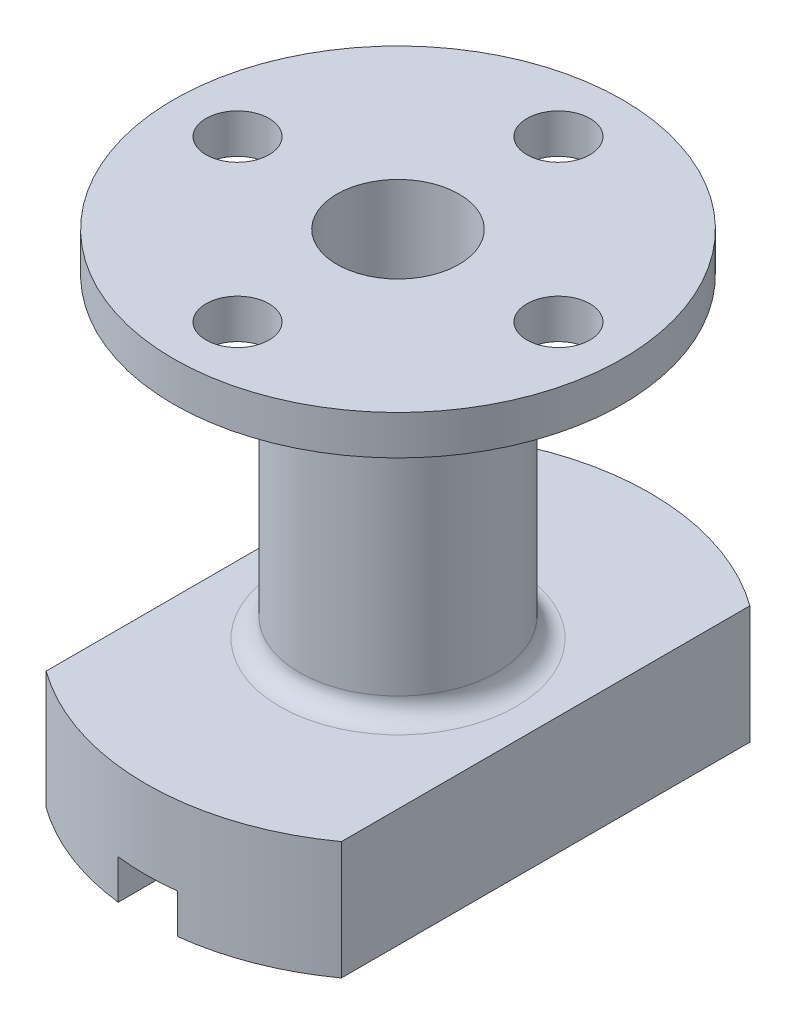
ISO-10303-21;
HEADER;
FILE_DESCRIPTION(('STEP AP214'),'2;1');
FILE_NAME('part.step','',(''),(''),'','','');
FILE_SCHEMA(('AUTOMOTIVE_DESIGN { 1 0 10303 214 1 1 1 1 }'));
ENDSEC;
DATA;
#1=APPLICATION_CONTEXT('core data for automotive mechanical design processes');
#2=APPLICATION_PROTOCOL_DEFINITION('international standard','automotive_design',2000,#1);
#3=PRODUCT_CONTEXT('',#1,'mechanical');
#4=PRODUCT('Part','Part','',(#3));
#5=PRODUCT_RELATED_PRODUCT_CATEGORY('part','',(#4));
#6=PRODUCT_DEFINITION_FORMATION('','',#4);
#7=PRODUCT_DEFINITION_CONTEXT('part definition',#1,'design');
#8=PRODUCT_DEFINITION('design','',#6,#7);
#9=PRODUCT_DEFINITION_SHAPE('','',#8);
#10=(LENGTH_UNIT() NAMED_UNIT(*) SI_UNIT(.MILLI.,.METRE.));
#11=(NAMED_UNIT(*) PLANE_ANGLE_UNIT() SI_UNIT($,.RADIAN.));
#12=(NAMED_UNIT(*) SI_UNIT($,.STERADIAN.) SOLID_ANGLE_UNIT());
#13=UNCERTAINTY_MEASURE_WITH_UNIT(LENGTH_MEASURE(1.E-05),#10,'distance_accuracy_value','');
#14=(GEOMETRIC_REPRESENTATION_CONTEXT(3) GLOBAL_UNCERTAINTY_ASSIGNED_CONTEXT((#13)) GLOBAL_UNIT_ASSIGNED_CONTEXT((#10,
#11,#12)) REPRESENTATION_CONTEXT('',''));
#15=CARTESIAN_POINT('',(0.,0.,0.));
#16=DIRECTION('',(0.,0.,1.));
#17=DIRECTION('',(1.,0.,0.));
#18=AXIS2_PLACEMENT_3D('',#15,#16,#17);
#19=CARTESIAN_POINT('',(1.5,2.,12.7118055365869));
#20=DIRECTION('',(1.,0.,0.));
#21=DIRECTION('',(0.,0.,-1.));
#22=AXIS2_PLACEMENT_3D('',#19,#20,#21);
#23=PLANE('',#22);
#24=DIRECTION('',(0.,0.,1.));
#25=VECTOR('',#24,1.);
#26=CARTESIAN_POINT('',(1.5,2.,12.7118055365869));
#27=LINE('',#26,#25);
#28=CARTESIAN_POINT('',(1.5,2.,2.71293199325011));
#29=VERTEX_POINT('',#28);
#30=CARTESIAN_POINT('',(1.5,2.,12.7118055365869));
#31=VERTEX_POINT('',#30);
#32=EDGE_CURVE('E275',#29,#31,#27,.T.);
#33=ORIENTED_EDGE('',*,*,#32,.F.);
#34=DIRECTION('',(0.,-1.,0.));
#35=VECTOR('',#34,1.);
#36=CARTESIAN_POINT('',(1.5,22.001,2.71293199325011));
#37=LINE('',#36,#35);
#38=CARTESIAN_POINT('',(1.5,0.,2.71293199325011));
#39=VERTEX_POINT('',#38);
#40=EDGE_CURVE('E135',#39,#29,#37,.F.);
#41=ORIENTED_EDGE('',*,*,#40,.F.);
#42=DIRECTION('',(0.,0.,1.));
#43=VECTOR('',#42,1.);
#44=CARTESIAN_POINT('',(1.5,0.,12.7118055365869));
#45=LINE('',#44,#43);
#46=CARTESIAN_POINT('',(1.5,0.,12.7118055365869));
#47=VERTEX_POINT('',#46);
#48=EDGE_CURVE('E153',#39,#47,#45,.T.);
#49=ORIENTED_EDGE('',*,*,#48,.T.);
#50=DIRECTION('',(0.,-1.,0.));
#51=VECTOR('',#50,1.);
#52=CARTESIAN_POINT('',(1.5,2.,12.7118055365869));
#53=LINE('',#52,#51);
#54=EDGE_CURVE('E165',#31,#47,#53,.T.);
#55=ORIENTED_EDGE('',*,*,#54,.F.);
#56=EDGE_LOOP('',(#33,#41,#49,#55));
#57=FACE_BOUND('',#56,.T.);
#58=ADVANCED_FACE('F39',(#57),#23,.F.);
#59=CARTESIAN_POINT('',(-1.5,2.,12.7118055365869));
#60=DIRECTION('',(-1.,0.,0.));
#61=DIRECTION('',(0.,0.,1.));
#62=AXIS2_PLACEMENT_3D('',#59,#60,#61);
#63=PLANE('',#62);
#64=DIRECTION('',(0.,0.,-1.));
#65=VECTOR('',#64,1.);
#66=CARTESIAN_POINT('',(-1.5,2.,12.7118055365869));
#67=LINE('',#66,#65);
#68=CARTESIAN_POINT('',(-1.5,2.,-2.71293199325011));
#69=VERTEX_POINT('',#68);
#70=CARTESIAN_POINT('',(-1.5,2.,-12.7118055365869));
#71=VERTEX_POINT('',#70);
#72=EDGE_CURVE('E143',#69,#71,#67,.T.);
#73=ORIENTED_EDGE('',*,*,#72,.F.);
#74=DIRECTION('',(0.,-1.,0.));
#75=VECTOR('',#74,1.);
#76=CARTESIAN_POINT('',(-1.5,22.001,-2.71293199325011));
#77=LINE('',#76,#75);
#78=CARTESIAN_POINT('',(-1.5,0.,-2.71293199325011));
#79=VERTEX_POINT('',#78);
#80=EDGE_CURVE('E54',#79,#69,#77,.F.);
#81=ORIENTED_EDGE('',*,*,#80,.F.);
#82=DIRECTION('',(0.,0.,-1.));
#83=VECTOR('',#82,1.);
#84=CARTESIAN_POINT('',(-1.5,0.,12.7118055365869));
#85=LINE('',#84,#83);
#86=CARTESIAN_POINT('',(-1.5,0.,-12.7118055365869));
#87=VERTEX_POINT('',#86);
#88=EDGE_CURVE('E141',#79,#87,#85,.T.);
#89=ORIENTED_EDGE('',*,*,#88,.T.);
#90=DIRECTION('',(0.,-1.,0.));
#91=VECTOR('',#90,1.);
#92=CARTESIAN_POINT('',(-1.5,2.,-12.7118055365869));
#93=LINE('',#92,#91);
#94=EDGE_CURVE('E170',#71,#87,#93,.T.);
#95=ORIENTED_EDGE('',*,*,#94,.F.);
#96=EDGE_LOOP('',(#73,#81,#89,#95));
#97=FACE_BOUND('',#96,.T.);
#98=ADVANCED_FACE('F139',(#97),#63,.F.);
#99=CARTESIAN_POINT('',(0.,2.,0.));
#100=DIRECTION('',(0.,-1.,0.));
#101=DIRECTION('',(0.,0.,-1.));
#102=AXIS2_PLACEMENT_3D('',#99,#100,#101);
#103=PLANE('',#102);
#104=CARTESIAN_POINT('',(0.,2.,0.));
#105=DIRECTION('',(0.,-1.,0.));
#106=DIRECTION('',(0.,0.,-1.));
#107=AXIS2_PLACEMENT_3D('',#104,#105,#106);
#108=CIRCLE('',#107,3.1);
#109=CARTESIAN_POINT('',(-1.5,2.,2.71293199325011));
#110=VERTEX_POINT('',#109);
#111=EDGE_CURVE('E155',#110,#29,#108,.F.);
#112=ORIENTED_EDGE('',*,*,#111,.T.);
#113=ORIENTED_EDGE('',*,*,#32,.T.);
#114=CARTESIAN_POINT('',(0.,2.,0.));
#115=DIRECTION('',(0.,-1.,0.));
#116=DIRECTION('',(0.,0.,-1.));
#117=AXIS2_PLACEMENT_3D('',#114,#115,#116);
#118=CIRCLE('',#117,12.8);
#119=CARTESIAN_POINT('',(-1.5,2.,12.7118055365869));
#120=VERTEX_POINT('',#119);
#121=EDGE_CURVE('E164',#31,#120,#118,.T.);
#122=ORIENTED_EDGE('',*,*,#121,.T.);
#123=EDGE_CURVE('E283',#120,#110,#67,.T.);
#124=ORIENTED_EDGE('',*,*,#123,.T.);
#125=EDGE_LOOP('',(#112,#113,#122,#124));
#126=FACE_BOUND('',#125,.T.);
#127=ADVANCED_FACE('F232',(#126),#103,.T.);
#128=CARTESIAN_POINT('',(0.,0.,0.));
#129=DIRECTION('',(0.,1.,0.));
#130=DIRECTION('',(0.,0.,1.));
#131=AXIS2_PLACEMENT_3D('',#128,#129,#130);
#132=PLANE('',#131);
#133=ORIENTED_EDGE('',*,*,#48,.F.);
#134=CARTESIAN_POINT('',(0.,0.,0.));
#135=DIRECTION('',(0.,-1.,0.));
#136=DIRECTION('',(0.,0.,-1.));
#137=AXIS2_PLACEMENT_3D('',#134,#135,#136);
#138=CIRCLE('',#137,3.1);
#139=CARTESIAN_POINT('',(1.5,0.,-2.71293199325011));
#140=VERTEX_POINT('',#139);
#141=EDGE_CURVE('E134',#140,#39,#138,.T.);
#142=ORIENTED_EDGE('',*,*,#141,.F.);
#143=CARTESIAN_POINT('',(1.5,0.,-12.7118055365868));
#144=VERTEX_POINT('',#143);
#145=EDGE_CURVE('E161',#144,#140,#45,.T.);
#146=ORIENTED_EDGE('',*,*,#145,.F.);
#147=CARTESIAN_POINT('',(0.,0.,0.));
#148=DIRECTION('',(0.,1.,0.));
#149=DIRECTION('',(0.,0.,1.));
#150=AXIS2_PLACEMENT_3D('',#147,#148,#149);
#151=CIRCLE('',#150,12.8);
#152=CARTESIAN_POINT('',(7.5,0.,-10.3725599540326));
#153=VERTEX_POINT('',#152);
#154=EDGE_CURVE('E184',#153,#144,#151,.T.);
#155=ORIENTED_EDGE('',*,*,#154,.F.);
#156=DIRECTION('',(0.,0.,-1.));
#157=VECTOR('',#156,1.);
#158=CARTESIAN_POINT('',(7.5,0.,-10.3725599540326));
#159=LINE('',#158,#157);
#160=CARTESIAN_POINT('',(7.5,0.,10.3725599540326));
#161=VERTEX_POINT('',#160);
#162=EDGE_CURVE('E177',#161,#153,#159,.T.);
#163=ORIENTED_EDGE('',*,*,#162,.F.);
#164=CARTESIAN_POINT('',(0.,0.,0.));
#165=DIRECTION('',(0.,1.,0.));
#166=DIRECTION('',(0.,0.,1.));
#167=AXIS2_PLACEMENT_3D('',#164,#165,#166);
#168=CIRCLE('',#167,12.8);
#169=EDGE_CURVE('E189',#47,#161,#168,.T.);
#170=ORIENTED_EDGE('',*,*,#169,.F.);
#171=EDGE_LOOP('',(#133,#142,#146,#155,#163,#170));
#172=FACE_BOUND('',#171,.T.);
#173=ADVANCED_FACE('F246',(#172),#132,.F.);
#174=CARTESIAN_POINT('',(0.,6.,0.));
#175=DIRECTION('',(0.,-1.,0.));
#176=DIRECTION('',(0.,0.,-1.));
#177=AXIS2_PLACEMENT_3D('',#174,#175,#176);
#178=CYLINDRICAL_SURFACE('',#177,12.8);
#179=ORIENTED_EDGE('',*,*,#154,.T.);
#180=DIRECTION('',(0.,-1.,0.));
#181=VECTOR('',#180,1.);
#182=CARTESIAN_POINT('',(1.5,2.,-12.7118055365868));
#183=LINE('',#182,#181);
#184=CARTESIAN_POINT('',(1.5,2.,-12.7118055365868));
#185=VERTEX_POINT('',#184);
#186=EDGE_CURVE('E168',#185,#144,#183,.T.);
#187=ORIENTED_EDGE('',*,*,#186,.F.);
#188=CARTESIAN_POINT('',(0.,2.,0.));
#189=DIRECTION('',(0.,-1.,0.));
#190=DIRECTION('',(0.,0.,-1.));
#191=AXIS2_PLACEMENT_3D('',#188,#189,#190);
#192=CIRCLE('',#191,12.8);
#193=EDGE_CURVE('E285',#71,#185,#192,.T.);
#194=ORIENTED_EDGE('',*,*,#193,.F.);
#195=ORIENTED_EDGE('',*,*,#94,.T.);
#196=CARTESIAN_POINT('',(-7.5,0.,-10.3725599540326));
#197=VERTEX_POINT('',#196);
#198=EDGE_CURVE('E149',#87,#197,#151,.T.);
#199=ORIENTED_EDGE('',*,*,#198,.T.);
#200=DIRECTION('',(0.,-1.,0.));
#201=VECTOR('',#200,1.);
#202=CARTESIAN_POINT('',(-7.5,6.,-10.3725599540326));
#203=LINE('',#202,#201);
#204=CARTESIAN_POINT('',(-7.5,6.,-10.3725599540326));
#205=VERTEX_POINT('',#204);
#206=EDGE_CURVE('E202',#205,#197,#203,.T.);
#207=ORIENTED_EDGE('',*,*,#206,.F.);
#208=CARTESIAN_POINT('',(0.,6.,0.));
#209=DIRECTION('',(0.,1.,0.));
#210=DIRECTION('',(0.,0.,1.));
#211=AXIS2_PLACEMENT_3D('',#208,#209,#210);
#212=CIRCLE('',#211,12.8);
#213=CARTESIAN_POINT('',(7.5,6.,-10.3725599540326));
#214=VERTEX_POINT('',#213);
#215=EDGE_CURVE('E173',#214,#205,#212,.T.);
#216=ORIENTED_EDGE('',*,*,#215,.F.);
#217=DIRECTION('',(0.,-1.,0.));
#218=VECTOR('',#217,1.);
#219=CARTESIAN_POINT('',(7.5,6.,-10.3725599540326));
#220=LINE('',#219,#218);
#221=EDGE_CURVE('E183',#214,#153,#220,.T.);
#222=ORIENTED_EDGE('',*,*,#221,.T.);
#223=EDGE_LOOP('',(#179,#187,#194,#195,#199,#207,#216,#222));
#224=FACE_BOUND('',#223,.T.);
#225=ADVANCED_FACE('F258',(#224),#178,.T.);
#226=CARTESIAN_POINT('',(-7.5,6.,-10.3725599540326));
#227=DIRECTION('',(1.,0.,0.));
#228=DIRECTION('',(0.,0.,-1.));
#229=AXIS2_PLACEMENT_3D('',#226,#227,#228);
#230=PLANE('',#229);
#231=DIRECTION('',(0.,0.,1.));
#232=VECTOR('',#231,1.);
#233=CARTESIAN_POINT('',(-7.5,0.,-10.3725599540326));
#234=LINE('',#233,#232);
#235=CARTESIAN_POINT('',(-7.5,0.,10.3725599540326));
#236=VERTEX_POINT('',#235);
#237=EDGE_CURVE('E187',#197,#236,#234,.T.);
#238=ORIENTED_EDGE('',*,*,#237,.T.);
#239=DIRECTION('',(0.,-1.,0.));
#240=VECTOR('',#239,1.);
#241=CARTESIAN_POINT('',(-7.5,6.,10.3725599540326));
#242=LINE('',#241,#240);
#243=CARTESIAN_POINT('',(-7.5,6.,10.3725599540326));
#244=VERTEX_POINT('',#243);
#245=EDGE_CURVE('E199',#244,#236,#242,.T.);
#246=ORIENTED_EDGE('',*,*,#245,.F.);
#247=DIRECTION('',(0.,0.,1.));
#248=VECTOR('',#247,1.);
#249=CARTESIAN_POINT('',(-7.5,6.,-10.3725599540326));
#250=LINE('',#249,#248);
#251=EDGE_CURVE('E176',#205,#244,#250,.T.);
#252=ORIENTED_EDGE('',*,*,#251,.F.);
#253=ORIENTED_EDGE('',*,*,#206,.T.);
#254=EDGE_LOOP('',(#238,#246,#252,#253));
#255=FACE_BOUND('',#254,.T.);
#256=ADVANCED_FACE('F291',(#255),#230,.F.);
#257=CARTESIAN_POINT('',(0.,6.,0.));
#258=DIRECTION('',(0.,-1.,0.));
#259=DIRECTION('',(0.,0.,-1.));
#260=AXIS2_PLACEMENT_3D('',#257,#258,#259);
#261=CYLINDRICAL_SURFACE('',#260,12.8);
#262=ORIENTED_EDGE('',*,*,#121,.F.);
#263=ORIENTED_EDGE('',*,*,#54,.T.);
#264=ORIENTED_EDGE('',*,*,#169,.T.);
#265=DIRECTION('',(0.,-1.,0.));
#266=VECTOR('',#265,1.);
#267=CARTESIAN_POINT('',(7.5,6.,10.3725599540326));
#268=LINE('',#267,#266);
#269=CARTESIAN_POINT('',(7.5,6.,10.3725599540326));
#270=VERTEX_POINT('',#269);
#271=EDGE_CURVE('E196',#270,#161,#268,.T.);
#272=ORIENTED_EDGE('',*,*,#271,.F.);
#273=CARTESIAN_POINT('',(0.,6.,0.));
#274=DIRECTION('',(0.,1.,0.));
#275=DIRECTION('',(0.,0.,1.));
#276=AXIS2_PLACEMENT_3D('',#273,#274,#275);
#277=CIRCLE('',#276,12.8);
#278=EDGE_CURVE('E179',#244,#270,#277,.T.);
#279=ORIENTED_EDGE('',*,*,#278,.F.);
#280=ORIENTED_EDGE('',*,*,#245,.T.);
#281=CARTESIAN_POINT('',(-1.5,0.,12.7118055365868));
#282=VERTEX_POINT('',#281);
#283=EDGE_CURVE('E190',#236,#282,#168,.T.);
#284=ORIENTED_EDGE('',*,*,#283,.T.);
#285=DIRECTION('',(0.,-1.,0.));
#286=VECTOR('',#285,1.);
#287=CARTESIAN_POINT('',(-1.5,2.,12.7118055365869));
#288=LINE('',#287,#286);
#289=EDGE_CURVE('E62',#120,#282,#288,.T.);
#290=ORIENTED_EDGE('',*,*,#289,.F.);
#291=EDGE_LOOP('',(#262,#263,#264,#272,#279,#280,#284,#290));
#292=FACE_BOUND('',#291,.T.);
#293=ADVANCED_FACE('F270',(#292),#261,.T.);
#294=CARTESIAN_POINT('',(7.5,6.,-10.3725599540326));
#295=DIRECTION('',(-1.,0.,0.));
#296=DIRECTION('',(0.,0.,1.));
#297=AXIS2_PLACEMENT_3D('',#294,#295,#296);
#298=PLANE('',#297);
#299=ORIENTED_EDGE('',*,*,#162,.T.);
#300=ORIENTED_EDGE('',*,*,#221,.F.);
#301=DIRECTION('',(0.,0.,-1.));
#302=VECTOR('',#301,1.);
#303=CARTESIAN_POINT('',(7.5,6.,-10.3725599540326));
#304=LINE('',#303,#302);
#305=EDGE_CURVE('E181',#270,#214,#304,.T.);
#306=ORIENTED_EDGE('',*,*,#305,.F.);
#307=ORIENTED_EDGE('',*,*,#271,.T.);
#308=EDGE_LOOP('',(#299,#300,#306,#307));
#309=FACE_BOUND('',#308,.T.);
#310=ADVANCED_FACE('F265',(#309),#298,.F.);
#311=CARTESIAN_POINT('',(0.,6.,0.));
#312=DIRECTION('',(0.,1.,0.));
#313=DIRECTION('',(0.,0.,1.));
#314=AXIS2_PLACEMENT_3D('',#311,#312,#313);
#315=PLANE('',#314);
#316=CARTESIAN_POINT('',(0.,6.,0.));
#317=DIRECTION('',(0.,1.,0.));
#318=DIRECTION('',(0.,0.,1.));
#319=AXIS2_PLACEMENT_3D('',#316,#317,#318);
#320=CIRCLE('',#319,6.);
#321=CARTESIAN_POINT('',(0.,6.,6.));
#322=VERTEX_POINT('',#321);
#323=EDGE_CURVE('E11',#322,#322,#320,.F.);
#324=ORIENTED_EDGE('',*,*,#323,.T.);
#325=EDGE_LOOP('',(#324));
#326=FACE_BOUND('',#325,.T.);
#327=ORIENTED_EDGE('',*,*,#215,.T.);
#328=ORIENTED_EDGE('',*,*,#251,.T.);
#329=ORIENTED_EDGE('',*,*,#278,.T.);
#330=ORIENTED_EDGE('',*,*,#305,.T.);
#331=EDGE_LOOP('',(#327,#328,#329,#330));
#332=FACE_BOUND('',#331,.T.);
#333=ADVANCED_FACE('F244',(#326,#332),#315,.T.);
#334=ORIENTED_EDGE('',*,*,#88,.F.);
#335=CARTESIAN_POINT('',(-1.5,0.,2.71293199325011));
#336=VERTEX_POINT('',#335);
#337=EDGE_CURVE('E127',#336,#79,#138,.T.);
#338=ORIENTED_EDGE('',*,*,#337,.F.);
#339=EDGE_CURVE('E150',#282,#336,#85,.T.);
#340=ORIENTED_EDGE('',*,*,#339,.F.);
#341=ORIENTED_EDGE('',*,*,#283,.F.);
#342=ORIENTED_EDGE('',*,*,#237,.F.);
#343=ORIENTED_EDGE('',*,*,#198,.F.);
#344=EDGE_LOOP('',(#334,#338,#340,#341,#342,#343));
#345=FACE_BOUND('',#344,.T.);
#346=ADVANCED_FACE('F147',(#345),#132,.F.);
#347=ORIENTED_EDGE('',*,*,#145,.T.);
#348=DIRECTION('',(0.,-1.,0.));
#349=VECTOR('',#348,1.);
#350=CARTESIAN_POINT('',(1.5,22.001,-2.71293199325011));
#351=LINE('',#350,#349);
#352=CARTESIAN_POINT('',(1.5,2.,-2.71293199325011));
#353=VERTEX_POINT('',#352);
#354=EDGE_CURVE('E144',#353,#140,#351,.T.);
#355=ORIENTED_EDGE('',*,*,#354,.F.);
#356=EDGE_CURVE('E159',#185,#353,#27,.T.);
#357=ORIENTED_EDGE('',*,*,#356,.F.);
#358=ORIENTED_EDGE('',*,*,#186,.T.);
#359=EDGE_LOOP('',(#347,#355,#357,#358));
#360=FACE_BOUND('',#359,.T.);
#361=ADVANCED_FACE('F227',(#360),#23,.F.);
#362=ORIENTED_EDGE('',*,*,#339,.T.);
#363=DIRECTION('',(0.,-1.,0.));
#364=VECTOR('',#363,1.);
#365=CARTESIAN_POINT('',(-1.5,22.001,2.71293199325011));
#366=LINE('',#365,#364);
#367=EDGE_CURVE('E131',#110,#336,#366,.T.);
#368=ORIENTED_EDGE('',*,*,#367,.F.);
#369=ORIENTED_EDGE('',*,*,#123,.F.);
#370=ORIENTED_EDGE('',*,*,#289,.T.);
#371=EDGE_LOOP('',(#362,#368,#369,#370));
#372=FACE_BOUND('',#371,.T.);
#373=ADVANCED_FACE('F234',(#372),#63,.F.);
#374=EDGE_CURVE('E280',#353,#69,#108,.F.);
#375=ORIENTED_EDGE('',*,*,#374,.T.);
#376=ORIENTED_EDGE('',*,*,#72,.T.);
#377=ORIENTED_EDGE('',*,*,#193,.T.);
#378=ORIENTED_EDGE('',*,*,#356,.T.);
#379=EDGE_LOOP('',(#375,#376,#377,#378));
#380=FACE_BOUND('',#379,.T.);
#381=ADVANCED_FACE('F243',(#380),#103,.T.);
#382=CARTESIAN_POINT('',(0.,22.,0.));
#383=DIRECTION('',(0.,-1.,0.));
#384=DIRECTION('',(0.,0.,-1.));
#385=AXIS2_PLACEMENT_3D('',#382,#383,#384);
#386=CYLINDRICAL_SURFACE('',#385,5.);
#387=CARTESIAN_POINT('',(0.,7.,0.));
#388=DIRECTION('',(0.,1.,0.));
#389=DIRECTION('',(0.,0.,1.));
#390=AXIS2_PLACEMENT_3D('',#387,#388,#389);
#391=CIRCLE('',#390,5.);
#392=CARTESIAN_POINT('',(0.,7.,5.));
#393=VERTEX_POINT('',#392);
#394=EDGE_CURVE('E47',#393,#393,#391,.T.);
#395=ORIENTED_EDGE('',*,*,#394,.T.);
#396=EDGE_LOOP('',(#395));
#397=FACE_BOUND('',#396,.T.);
#398=CARTESIAN_POINT('',(0.,22.,0.));
#399=DIRECTION('',(0.,1.,0.));
#400=DIRECTION('',(0.,0.,1.));
#401=AXIS2_PLACEMENT_3D('',#398,#399,#400);
#402=CIRCLE('',#401,5.);
#403=CARTESIAN_POINT('',(0.,22.,5.));
#404=VERTEX_POINT('',#403);
#405=EDGE_CURVE('E151',#404,#404,#402,.T.);
#406=ORIENTED_EDGE('',*,*,#405,.F.);
#407=EDGE_LOOP('',(#406));
#408=FACE_BOUND('',#407,.T.);
#409=ADVANCED_FACE('F207',(#397,#408),#386,.T.);
#410=CARTESIAN_POINT('',(0.,22.001,0.));
#411=DIRECTION('',(0.,-1.,0.));
#412=DIRECTION('',(0.,0.,-1.));
#413=AXIS2_PLACEMENT_3D('',#410,#411,#412);
#414=CYLINDRICAL_SURFACE('',#413,3.1);
#415=ORIENTED_EDGE('',*,*,#40,.T.);
#416=ORIENTED_EDGE('',*,*,#111,.F.);
#417=ORIENTED_EDGE('',*,*,#367,.T.);
#418=ORIENTED_EDGE('',*,*,#337,.T.);
#419=ORIENTED_EDGE('',*,*,#80,.T.);
#420=ORIENTED_EDGE('',*,*,#374,.F.);
#421=ORIENTED_EDGE('',*,*,#354,.T.);
#422=ORIENTED_EDGE('',*,*,#141,.T.);
#423=EDGE_LOOP('',(#415,#416,#417,#418,#419,#420,#421,#422));
#424=FACE_BOUND('',#423,.T.);
#425=CARTESIAN_POINT('',(0.,24.,0.));
#426=DIRECTION('',(0.,-1.,0.));
#427=DIRECTION('',(0.,0.,-1.));
#428=AXIS2_PLACEMENT_3D('',#425,#426,#427);
#429=CIRCLE('',#428,3.1);
#430=CARTESIAN_POINT('',(0.,24.,-3.1));
#431=VERTEX_POINT('',#430);
#432=EDGE_CURVE('E351',#431,#431,#429,.T.);
#433=ORIENTED_EDGE('',*,*,#432,.F.);
#434=EDGE_LOOP('',(#433));
#435=FACE_BOUND('',#434,.T.);
#436=ADVANCED_FACE('F128',(#424,#435),#414,.F.);
#437=CARTESIAN_POINT('',(0.,7.,0.));
#438=DIRECTION('',(0.,1.,0.));
#439=DIRECTION('',(0.,0.,1.));
#440=AXIS2_PLACEMENT_3D('',#437,#438,#439);
#441=TOROIDAL_SURFACE('',#440,6.,1.);
#442=ORIENTED_EDGE('',*,*,#323,.F.);
#443=EDGE_LOOP('',(#442));
#444=FACE_BOUND('',#443,.T.);
#445=ORIENTED_EDGE('',*,*,#394,.F.);
#446=EDGE_LOOP('',(#445));
#447=FACE_BOUND('',#446,.T.);
#448=ADVANCED_FACE('F41',(#444,#447),#441,.F.);
#449=CARTESIAN_POINT('',(0.,22.,0.));
#450=DIRECTION('',(0.,1.,0.));
#451=DIRECTION('',(0.,0.,1.));
#452=AXIS2_PLACEMENT_3D('',#449,#450,#451);
#453=PLANE('',#452);
#454=CARTESIAN_POINT('',(0.,22.,-8.15));
#455=DIRECTION('',(0.,1.,0.));
#456=DIRECTION('',(0.,0.,1.));
#457=AXIS2_PLACEMENT_3D('',#454,#455,#456);
#458=CIRCLE('',#457,1.6);
#459=CARTESIAN_POINT('',(0.,22.,-6.55));
#460=VERTEX_POINT('',#459);
#461=EDGE_CURVE('E345',#460,#460,#458,.T.);
#462=ORIENTED_EDGE('',*,*,#461,.T.);
#463=EDGE_LOOP('',(#462));
#464=FACE_BOUND('',#463,.T.);
#465=CARTESIAN_POINT('',(0.,22.,8.15));
#466=DIRECTION('',(0.,1.,0.));
#467=DIRECTION('',(0.,0.,-1.));
#468=AXIS2_PLACEMENT_3D('',#465,#466,#467);
#469=CIRCLE('',#468,1.6);
#470=CARTESIAN_POINT('',(0.,22.,6.55));
#471=VERTEX_POINT('',#470);
#472=EDGE_CURVE('E354',#471,#471,#469,.T.);
#473=ORIENTED_EDGE('',*,*,#472,.T.);
#474=EDGE_LOOP('',(#473));
#475=FACE_BOUND('',#474,.T.);
#476=CARTESIAN_POINT('',(-8.14999999999988,22.,3.43475248243408E-13));
#477=DIRECTION('',(0.,1.,0.));
#478=DIRECTION('',(0.,0.,1.));
#479=AXIS2_PLACEMENT_3D('',#476,#477,#478);
#480=CIRCLE('',#479,1.60000000000027);
#481=CARTESIAN_POINT('',(-8.14999999999988,22.,1.60000000000061));
#482=VERTEX_POINT('',#481);
#483=EDGE_CURVE('E362',#482,#482,#480,.T.);
#484=ORIENTED_EDGE('',*,*,#483,.T.);
#485=EDGE_LOOP('',(#484));
#486=FACE_BOUND('',#485,.T.);
#487=CARTESIAN_POINT('',(8.14999999999988,22.,3.22658566531686E-13));
#488=DIRECTION('',(0.,1.,0.));
#489=DIRECTION('',(0.,0.,-1.));
#490=AXIS2_PLACEMENT_3D('',#487,#488,#489);
#491=CIRCLE('',#490,1.60000000000012);
#492=CARTESIAN_POINT('',(8.14999999999988,22.,-1.5999999999998));
#493=VERTEX_POINT('',#492);
#494=EDGE_CURVE('E368',#493,#493,#491,.T.);
#495=ORIENTED_EDGE('',*,*,#494,.T.);
#496=EDGE_LOOP('',(#495));
#497=FACE_BOUND('',#496,.T.);
#498=ORIENTED_EDGE('',*,*,#405,.T.);
#499=EDGE_LOOP('',(#498));
#500=FACE_BOUND('',#499,.T.);
#501=CARTESIAN_POINT('',(0.,22.,0.));
#502=DIRECTION('',(0.,1.,0.));
#503=DIRECTION('',(0.,0.,1.));
#504=AXIS2_PLACEMENT_3D('',#501,#502,#503);
#505=CIRCLE('',#504,11.4);
#506=CARTESIAN_POINT('',(0.,22.,11.4));
#507=VERTEX_POINT('',#506);
#508=EDGE_CURVE('E373',#507,#507,#505,.T.);
#509=ORIENTED_EDGE('',*,*,#508,.F.);
#510=EDGE_LOOP('',(#509));
#511=FACE_BOUND('',#510,.T.);
#512=ADVANCED_FACE('F211',(#464,#475,#486,#497,#500,#511),#453,.F.);
#513=CARTESIAN_POINT('',(0.,24.,0.));
#514=DIRECTION('',(0.,1.,0.));
#515=DIRECTION('',(0.,0.,1.));
#516=AXIS2_PLACEMENT_3D('',#513,#514,#515);
#517=PLANE('',#516);
#518=CARTESIAN_POINT('',(0.,24.,-8.15));
#519=DIRECTION('',(0.,1.,0.));
#520=DIRECTION('',(0.,0.,1.));
#521=AXIS2_PLACEMENT_3D('',#518,#519,#520);
#522=CIRCLE('',#521,1.6);
#523=CARTESIAN_POINT('',(0.,24.,-6.55));
#524=VERTEX_POINT('',#523);
#525=EDGE_CURVE('E348',#524,#524,#522,.T.);
#526=ORIENTED_EDGE('',*,*,#525,.F.);
#527=EDGE_LOOP('',(#526));
#528=FACE_BOUND('',#527,.T.);
#529=CARTESIAN_POINT('',(0.,24.,8.15));
#530=DIRECTION('',(0.,1.,0.));
#531=DIRECTION('',(0.,0.,-1.));
#532=AXIS2_PLACEMENT_3D('',#529,#530,#531);
#533=CIRCLE('',#532,1.6);
#534=CARTESIAN_POINT('',(0.,24.,6.55));
#535=VERTEX_POINT('',#534);
#536=EDGE_CURVE('E349',#535,#535,#533,.T.);
#537=ORIENTED_EDGE('',*,*,#536,.F.);
#538=EDGE_LOOP('',(#537));
#539=FACE_BOUND('',#538,.T.);
#540=CARTESIAN_POINT('',(-8.14999999999988,24.,3.43475248243408E-13));
#541=DIRECTION('',(0.,1.,0.));
#542=DIRECTION('',(0.,0.,1.));
#543=AXIS2_PLACEMENT_3D('',#540,#541,#542);
#544=CIRCLE('',#543,1.60000000000027);
#545=CARTESIAN_POINT('',(-8.14999999999988,24.,1.60000000000061));
#546=VERTEX_POINT('',#545);
#547=EDGE_CURVE('E359',#546,#546,#544,.T.);
#548=ORIENTED_EDGE('',*,*,#547,.F.);
#549=EDGE_LOOP('',(#548));
#550=FACE_BOUND('',#549,.T.);
#551=CARTESIAN_POINT('',(8.14999999999988,24.,3.22658566531686E-13));
#552=DIRECTION('',(0.,1.,0.));
#553=DIRECTION('',(0.,0.,-1.));
#554=AXIS2_PLACEMENT_3D('',#551,#552,#553);
#555=CIRCLE('',#554,1.60000000000012);
#556=CARTESIAN_POINT('',(8.14999999999988,24.,-1.5999999999998));
#557=VERTEX_POINT('',#556);
#558=EDGE_CURVE('E365',#557,#557,#555,.T.);
#559=ORIENTED_EDGE('',*,*,#558,.F.);
#560=EDGE_LOOP('',(#559));
#561=FACE_BOUND('',#560,.T.);
#562=ORIENTED_EDGE('',*,*,#432,.T.);
#563=EDGE_LOOP('',(#562));
#564=FACE_BOUND('',#563,.T.);
#565=CARTESIAN_POINT('',(0.,24.,0.));
#566=DIRECTION('',(0.,1.,0.));
#567=DIRECTION('',(0.,0.,1.));
#568=AXIS2_PLACEMENT_3D('',#565,#566,#567);
#569=CIRCLE('',#568,11.4);
#570=CARTESIAN_POINT('',(0.,24.,11.4));
#571=VERTEX_POINT('',#570);
#572=EDGE_CURVE('E374',#571,#571,#569,.T.);
#573=ORIENTED_EDGE('',*,*,#572,.T.);
#574=EDGE_LOOP('',(#573));
#575=FACE_BOUND('',#574,.T.);
#576=ADVANCED_FACE('F218',(#528,#539,#550,#561,#564,#575),#517,.T.);
#577=CARTESIAN_POINT('',(0.,24.,0.));
#578=DIRECTION('',(0.,-1.,0.));
#579=DIRECTION('',(0.,0.,-1.));
#580=AXIS2_PLACEMENT_3D('',#577,#578,#579);
#581=CYLINDRICAL_SURFACE('',#580,11.4);
#582=ORIENTED_EDGE('',*,*,#572,.F.);
#583=EDGE_LOOP('',(#582));
#584=FACE_BOUND('',#583,.T.);
#585=ORIENTED_EDGE('',*,*,#508,.T.);
#586=EDGE_LOOP('',(#585));
#587=FACE_BOUND('',#586,.T.);
#588=ADVANCED_FACE('F319',(#584,#587),#581,.T.);
#589=CARTESIAN_POINT('',(8.14999999999988,22.,3.22658566531686E-13));
#590=DIRECTION('',(0.,1.,0.));
#591=DIRECTION('',(0.,0.,1.));
#592=AXIS2_PLACEMENT_3D('',#589,#590,#591);
#593=CYLINDRICAL_SURFACE('',#592,1.60000000000012);
#594=ORIENTED_EDGE('',*,*,#494,.F.);
#595=EDGE_LOOP('',(#594));
#596=FACE_BOUND('',#595,.T.);
#597=ORIENTED_EDGE('',*,*,#558,.T.);
#598=EDGE_LOOP('',(#597));
#599=FACE_BOUND('',#598,.T.);
#600=ADVANCED_FACE('F320',(#596,#599),#593,.F.);
#601=CARTESIAN_POINT('',(-8.14999999999988,22.,3.43475248243408E-13));
#602=DIRECTION('',(0.,1.,0.));
#603=DIRECTION('',(0.,0.,1.));
#604=AXIS2_PLACEMENT_3D('',#601,#602,#603);
#605=CYLINDRICAL_SURFACE('',#604,1.60000000000027);
#606=ORIENTED_EDGE('',*,*,#483,.F.);
#607=EDGE_LOOP('',(#606));
#608=FACE_BOUND('',#607,.T.);
#609=ORIENTED_EDGE('',*,*,#547,.T.);
#610=EDGE_LOOP('',(#609));
#611=FACE_BOUND('',#610,.T.);
#612=ADVANCED_FACE('F328',(#608,#611),#605,.F.);
#613=CARTESIAN_POINT('',(0.,22.,8.15));
#614=DIRECTION('',(0.,1.,0.));
#615=DIRECTION('',(0.,0.,1.));
#616=AXIS2_PLACEMENT_3D('',#613,#614,#615);
#617=CYLINDRICAL_SURFACE('',#616,1.6);
#618=ORIENTED_EDGE('',*,*,#472,.F.);
#619=EDGE_LOOP('',(#618));
#620=FACE_BOUND('',#619,.T.);
#621=ORIENTED_EDGE('',*,*,#536,.T.);
#622=EDGE_LOOP('',(#621));
#623=FACE_BOUND('',#622,.T.);
#624=ADVANCED_FACE('F332',(#620,#623),#617,.F.);
#625=CARTESIAN_POINT('',(0.,22.,-8.15));
#626=DIRECTION('',(0.,1.,0.));
#627=DIRECTION('',(0.,0.,1.));
#628=AXIS2_PLACEMENT_3D('',#625,#626,#627);
#629=CYLINDRICAL_SURFACE('',#628,1.6);
#630=ORIENTED_EDGE('',*,*,#461,.F.);
#631=EDGE_LOOP('',(#630));
#632=FACE_BOUND('',#631,.T.);
#633=ORIENTED_EDGE('',*,*,#525,.T.);
#634=EDGE_LOOP('',(#633));
#635=FACE_BOUND('',#634,.T.);
#636=ADVANCED_FACE('F336',(#632,#635),#629,.F.);
#637=CLOSED_SHELL('',(#58,#98,#127,#173,#225,#256,#293,#310,#333,#346,#361,#373,#381,#409,#436,
#448,#512,#576,#588,#600,#612,#624,#636));
#638=MANIFOLD_SOLID_BREP('B2',#637);
#639=ADVANCED_BREP_SHAPE_REPRESENTATION('',(#18,#638),#14);
#640=SHAPE_DEFINITION_REPRESENTATION(#9,#639);
ENDSEC;
END-ISO-10303-21;
